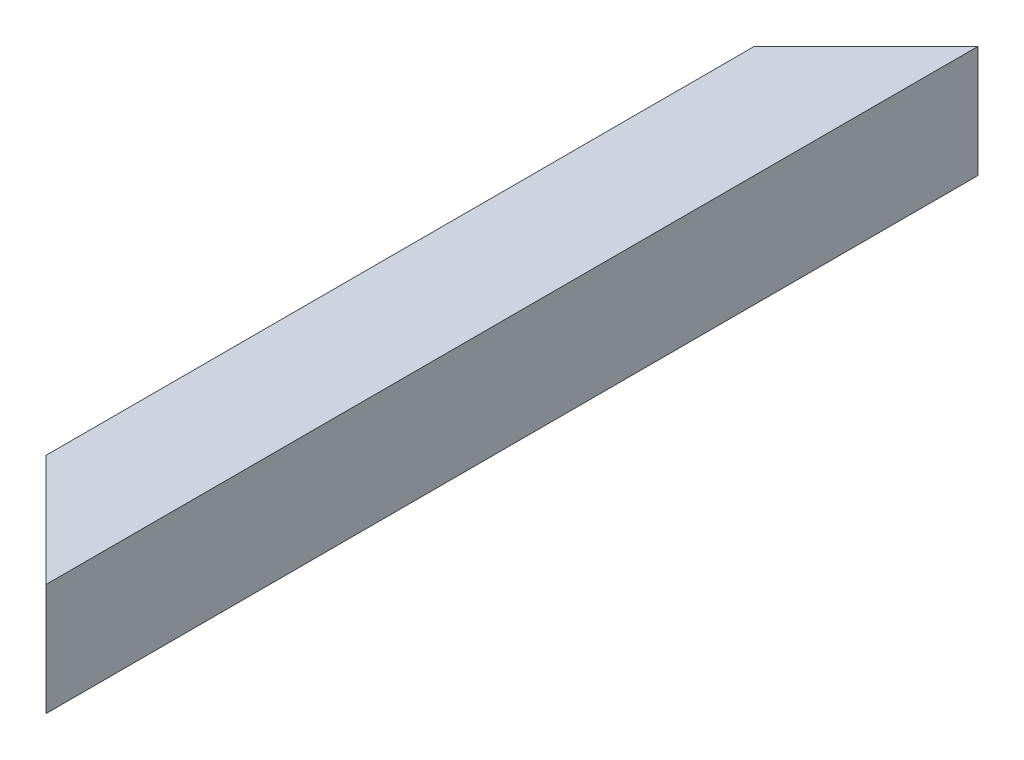
ISO-10303-21;
HEADER;
FILE_DESCRIPTION(('STEP AP214'),'2;1');
FILE_NAME('part.step','',(''),(''),'','','');
FILE_SCHEMA(('AUTOMOTIVE_DESIGN { 1 0 10303 214 1 1 1 1 }'));
ENDSEC;
DATA;
#1=APPLICATION_CONTEXT('core data for automotive mechanical design processes');
#2=APPLICATION_PROTOCOL_DEFINITION('international standard','automotive_design',2000,#1);
#3=PRODUCT_CONTEXT('',#1,'mechanical');
#4=PRODUCT('Part','Part','',(#3));
#5=PRODUCT_RELATED_PRODUCT_CATEGORY('part','',(#4));
#6=PRODUCT_DEFINITION_FORMATION('','',#4);
#7=PRODUCT_DEFINITION_CONTEXT('part definition',#1,'design');
#8=PRODUCT_DEFINITION('design','',#6,#7);
#9=PRODUCT_DEFINITION_SHAPE('','',#8);
#10=(LENGTH_UNIT() NAMED_UNIT(*) SI_UNIT(.MILLI.,.METRE.));
#11=(NAMED_UNIT(*) PLANE_ANGLE_UNIT() SI_UNIT($,.RADIAN.));
#12=(NAMED_UNIT(*) SI_UNIT($,.STERADIAN.) SOLID_ANGLE_UNIT());
#13=UNCERTAINTY_MEASURE_WITH_UNIT(LENGTH_MEASURE(1.E-05),#10,'distance_accuracy_value','');
#14=(GEOMETRIC_REPRESENTATION_CONTEXT(3) GLOBAL_UNCERTAINTY_ASSIGNED_CONTEXT((#13)) GLOBAL_UNIT_ASSIGNED_CONTEXT((#10,
#11,#12)) REPRESENTATION_CONTEXT('',''));
#15=CARTESIAN_POINT('',(0.,0.,0.));
#16=DIRECTION('',(0.,0.,1.));
#17=DIRECTION('',(1.,0.,0.));
#18=AXIS2_PLACEMENT_3D('',#15,#16,#17);
#19=CARTESIAN_POINT('',(-26.,26.,0.));
#20=DIRECTION('',(1.,0.,0.));
#21=DIRECTION('',(0.,0.,-1.));
#22=AXIS2_PLACEMENT_3D('',#19,#20,#21);
#23=PLANE('',#22);
#24=DIRECTION('',(0.,-1.,0.));
#25=VECTOR('',#24,1.);
#26=CARTESIAN_POINT('',(-26.,26.,55.9999999999994));
#27=LINE('',#26,#25);
#28=CARTESIAN_POINT('',(-26.,26.,55.9999999999994));
#29=VERTEX_POINT('',#28);
#30=CARTESIAN_POINT('',(-26.,-26.,55.9999999999994));
#31=VERTEX_POINT('',#30);
#32=EDGE_CURVE('E11',#29,#31,#27,.T.);
#33=ORIENTED_EDGE('',*,*,#32,.F.);
#34=DIRECTION('',(0.,0.,1.));
#35=VECTOR('',#34,1.);
#36=CARTESIAN_POINT('',(-26.,26.,0.));
#37=LINE('',#36,#35);
#38=CARTESIAN_POINT('',(-26.,26.,444.000000000001));
#39=VERTEX_POINT('',#38);
#40=EDGE_CURVE('E145',#29,#39,#37,.T.);
#41=ORIENTED_EDGE('',*,*,#40,.T.);
#42=DIRECTION('',(0.,1.,0.));
#43=VECTOR('',#42,1.);
#44=CARTESIAN_POINT('',(-26.,26.,444.000000000001));
#45=LINE('',#44,#43);
#46=CARTESIAN_POINT('',(-26.,-26.,444.000000000001));
#47=VERTEX_POINT('',#46);
#48=EDGE_CURVE('E43',#47,#39,#45,.T.);
#49=ORIENTED_EDGE('',*,*,#48,.F.);
#50=DIRECTION('',(0.,0.,1.));
#51=VECTOR('',#50,1.);
#52=CARTESIAN_POINT('',(-26.,-26.,0.));
#53=LINE('',#52,#51);
#54=EDGE_CURVE('E132',#31,#47,#53,.T.);
#55=ORIENTED_EDGE('',*,*,#54,.F.);
#56=EDGE_LOOP('',(#33,#41,#49,#55));
#57=FACE_BOUND('',#56,.T.);
#58=ADVANCED_FACE('F35',(#57),#23,.T.);
#59=CARTESIAN_POINT('',(-26.,-26.,0.));
#60=DIRECTION('',(0.,1.,0.));
#61=DIRECTION('',(0.,0.,1.));
#62=AXIS2_PLACEMENT_3D('',#59,#60,#61);
#63=PLANE('',#62);
#64=DIRECTION('',(0.707106781186551,0.,-0.707106781186544));
#65=VECTOR('',#64,1.);
#66=CARTESIAN_POINT('',(1.9999999999997,-26.,28.));
#67=LINE('',#66,#65);
#68=CARTESIAN_POINT('',(26.,-26.,3.99999999999995));
#69=VERTEX_POINT('',#68);
#70=EDGE_CURVE('E165',#31,#69,#67,.T.);
#71=ORIENTED_EDGE('',*,*,#70,.F.);
#72=ORIENTED_EDGE('',*,*,#54,.T.);
#73=DIRECTION('',(-0.707106781186551,0.,-0.707106781186544));
#74=VECTOR('',#73,1.);
#75=CARTESIAN_POINT('',(-248.,-26.,222.000000000003));
#76=LINE('',#75,#74);
#77=CARTESIAN_POINT('',(26.,-26.,496.));
#78=VERTEX_POINT('',#77);
#79=EDGE_CURVE('E57',#78,#47,#76,.T.);
#80=ORIENTED_EDGE('',*,*,#79,.F.);
#81=DIRECTION('',(0.,0.,1.));
#82=VECTOR('',#81,1.);
#83=CARTESIAN_POINT('',(26.,-26.,0.));
#84=LINE('',#83,#82);
#85=EDGE_CURVE('E135',#69,#78,#84,.T.);
#86=ORIENTED_EDGE('',*,*,#85,.F.);
#87=EDGE_LOOP('',(#71,#72,#80,#86));
#88=FACE_BOUND('',#87,.T.);
#89=ADVANCED_FACE('F181',(#88),#63,.T.);
#90=CARTESIAN_POINT('',(26.,26.,0.));
#91=DIRECTION('',(-1.,0.,0.));
#92=DIRECTION('',(0.,0.,1.));
#93=AXIS2_PLACEMENT_3D('',#90,#91,#92);
#94=PLANE('',#93);
#95=DIRECTION('',(0.,1.,0.));
#96=VECTOR('',#95,1.);
#97=CARTESIAN_POINT('',(26.,26.,3.99999999999995));
#98=LINE('',#97,#96);
#99=CARTESIAN_POINT('',(26.,26.,3.99999999999995));
#100=VERTEX_POINT('',#99);
#101=EDGE_CURVE('E167',#69,#100,#98,.T.);
#102=ORIENTED_EDGE('',*,*,#101,.F.);
#103=ORIENTED_EDGE('',*,*,#85,.T.);
#104=DIRECTION('',(0.,-1.,0.));
#105=VECTOR('',#104,1.);
#106=CARTESIAN_POINT('',(26.,26.,496.));
#107=LINE('',#106,#105);
#108=CARTESIAN_POINT('',(26.,26.,496.));
#109=VERTEX_POINT('',#108);
#110=EDGE_CURVE('E161',#109,#78,#107,.T.);
#111=ORIENTED_EDGE('',*,*,#110,.F.);
#112=DIRECTION('',(0.,0.,1.));
#113=VECTOR('',#112,1.);
#114=CARTESIAN_POINT('',(26.,26.,0.));
#115=LINE('',#114,#113);
#116=EDGE_CURVE('E141',#100,#109,#115,.T.);
#117=ORIENTED_EDGE('',*,*,#116,.F.);
#118=EDGE_LOOP('',(#102,#103,#111,#117));
#119=FACE_BOUND('',#118,.T.);
#120=ADVANCED_FACE('F178',(#119),#94,.T.);
#121=CARTESIAN_POINT('',(-26.,26.,0.));
#122=DIRECTION('',(0.,-1.,0.));
#123=DIRECTION('',(0.,0.,-1.));
#124=AXIS2_PLACEMENT_3D('',#121,#122,#123);
#125=PLANE('',#124);
#126=DIRECTION('',(-0.707106781186551,0.,0.707106781186544));
#127=VECTOR('',#126,1.);
#128=CARTESIAN_POINT('',(1.9999999999997,26.,28.));
#129=LINE('',#128,#127);
#130=EDGE_CURVE('E49',#100,#29,#129,.T.);
#131=ORIENTED_EDGE('',*,*,#130,.F.);
#132=ORIENTED_EDGE('',*,*,#116,.T.);
#133=DIRECTION('',(0.707106781186551,0.,0.707106781186544));
#134=VECTOR('',#133,1.);
#135=CARTESIAN_POINT('',(-248.,26.,222.000000000003));
#136=LINE('',#135,#134);
#137=EDGE_CURVE('E163',#39,#109,#136,.T.);
#138=ORIENTED_EDGE('',*,*,#137,.F.);
#139=ORIENTED_EDGE('',*,*,#40,.F.);
#140=EDGE_LOOP('',(#131,#132,#138,#139));
#141=FACE_BOUND('',#140,.T.);
#142=ADVANCED_FACE('F173',(#141),#125,.T.);
#143=CARTESIAN_POINT('',(30.,-30.,500.));
#144=DIRECTION('',(0.707106781186544,0.,-0.707106781186551));
#145=DIRECTION('',(-0.707106781186551,0.,-0.707106781186544));
#146=AXIS2_PLACEMENT_3D('',#143,#144,#145);
#147=PLANE('',#146);
#148=ORIENTED_EDGE('',*,*,#137,.T.);
#149=ORIENTED_EDGE('',*,*,#110,.T.);
#150=ORIENTED_EDGE('',*,*,#79,.T.);
#151=ORIENTED_EDGE('',*,*,#48,.T.);
#152=EDGE_LOOP('',(#148,#149,#150,#151));
#153=FACE_BOUND('',#152,.T.);
#154=DIRECTION('',(-0.707106781186551,0.,-0.707106781186543));
#155=VECTOR('',#154,1.);
#156=CARTESIAN_POINT('',(30.,30.,500.));
#157=LINE('',#156,#155);
#158=CARTESIAN_POINT('',(30.,30.,500.));
#159=VERTEX_POINT('',#158);
#160=CARTESIAN_POINT('',(-30.,30.,440.000000000001));
#161=VERTEX_POINT('',#160);
#162=EDGE_CURVE('E154',#159,#161,#157,.T.);
#163=ORIENTED_EDGE('',*,*,#162,.T.);
#164=DIRECTION('',(0.,1.,0.));
#165=VECTOR('',#164,1.);
#166=CARTESIAN_POINT('',(-30.,-30.,440.000000000001));
#167=LINE('',#166,#165);
#168=CARTESIAN_POINT('',(-30.,-30.,440.000000000001));
#169=VERTEX_POINT('',#168);
#170=EDGE_CURVE('E156',#169,#161,#167,.T.);
#171=ORIENTED_EDGE('',*,*,#170,.F.);
#172=DIRECTION('',(-0.707106781186551,0.,-0.707106781186543));
#173=VECTOR('',#172,1.);
#174=CARTESIAN_POINT('',(30.,-30.,500.));
#175=LINE('',#174,#173);
#176=CARTESIAN_POINT('',(30.,-30.,500.));
#177=VERTEX_POINT('',#176);
#178=EDGE_CURVE('E122',#177,#169,#175,.T.);
#179=ORIENTED_EDGE('',*,*,#178,.F.);
#180=DIRECTION('',(0.,1.,0.));
#181=VECTOR('',#180,1.);
#182=CARTESIAN_POINT('',(30.,30.,500.));
#183=LINE('',#182,#181);
#184=EDGE_CURVE('E144',#177,#159,#183,.T.);
#185=ORIENTED_EDGE('',*,*,#184,.T.);
#186=EDGE_LOOP('',(#163,#171,#179,#185));
#187=FACE_BOUND('',#186,.T.);
#188=ADVANCED_FACE('F180',(#153,#187),#147,.F.);
#189=CARTESIAN_POINT('',(30.,-30.,0.));
#190=DIRECTION('',(0.707106781186544,0.,0.707106781186551));
#191=DIRECTION('',(0.707106781186551,0.,-0.707106781186544));
#192=AXIS2_PLACEMENT_3D('',#189,#190,#191);
#193=PLANE('',#192);
#194=ORIENTED_EDGE('',*,*,#130,.T.);
#195=ORIENTED_EDGE('',*,*,#32,.T.);
#196=ORIENTED_EDGE('',*,*,#70,.T.);
#197=ORIENTED_EDGE('',*,*,#101,.T.);
#198=EDGE_LOOP('',(#194,#195,#196,#197));
#199=FACE_BOUND('',#198,.T.);
#200=DIRECTION('',(0.707106781186551,0.,-0.707106781186544));
#201=VECTOR('',#200,1.);
#202=CARTESIAN_POINT('',(30.,30.,0.));
#203=LINE('',#202,#201);
#204=CARTESIAN_POINT('',(-30.,30.,59.9999999999994));
#205=VERTEX_POINT('',#204);
#206=CARTESIAN_POINT('',(30.,30.,0.));
#207=VERTEX_POINT('',#206);
#208=EDGE_CURVE('E109',#205,#207,#203,.T.);
#209=ORIENTED_EDGE('',*,*,#208,.T.);
#210=DIRECTION('',(0.,1.,0.));
#211=VECTOR('',#210,1.);
#212=CARTESIAN_POINT('',(30.,30.,0.));
#213=LINE('',#212,#211);
#214=CARTESIAN_POINT('',(30.,-30.,0.));
#215=VERTEX_POINT('',#214);
#216=EDGE_CURVE('E104',#215,#207,#213,.T.);
#217=ORIENTED_EDGE('',*,*,#216,.F.);
#218=DIRECTION('',(0.707106781186551,0.,-0.707106781186544));
#219=VECTOR('',#218,1.);
#220=CARTESIAN_POINT('',(30.,-30.,0.));
#221=LINE('',#220,#219);
#222=CARTESIAN_POINT('',(-30.,-30.,59.9999999999994));
#223=VERTEX_POINT('',#222);
#224=EDGE_CURVE('E98',#223,#215,#221,.T.);
#225=ORIENTED_EDGE('',*,*,#224,.F.);
#226=DIRECTION('',(0.,1.,0.));
#227=VECTOR('',#226,1.);
#228=CARTESIAN_POINT('',(-30.,-30.,59.9999999999994));
#229=LINE('',#228,#227);
#230=EDGE_CURVE('E101',#223,#205,#229,.T.);
#231=ORIENTED_EDGE('',*,*,#230,.T.);
#232=EDGE_LOOP('',(#209,#217,#225,#231));
#233=FACE_BOUND('',#232,.T.);
#234=ADVANCED_FACE('F100',(#199,#233),#193,.F.);
#235=CARTESIAN_POINT('',(-30.,30.,0.));
#236=DIRECTION('',(-1.,0.,0.));
#237=DIRECTION('',(0.,0.,1.));
#238=AXIS2_PLACEMENT_3D('',#235,#236,#237);
#239=PLANE('',#238);
#240=ORIENTED_EDGE('',*,*,#230,.F.);
#241=DIRECTION('',(0.,0.,1.));
#242=VECTOR('',#241,1.);
#243=CARTESIAN_POINT('',(-30.,-30.,0.));
#244=LINE('',#243,#242);
#245=EDGE_CURVE('E116',#223,#169,#244,.T.);
#246=ORIENTED_EDGE('',*,*,#245,.T.);
#247=ORIENTED_EDGE('',*,*,#170,.T.);
#248=DIRECTION('',(0.,0.,1.));
#249=VECTOR('',#248,1.);
#250=CARTESIAN_POINT('',(-30.,30.,0.));
#251=LINE('',#250,#249);
#252=EDGE_CURVE('E118',#205,#161,#251,.T.);
#253=ORIENTED_EDGE('',*,*,#252,.F.);
#254=EDGE_LOOP('',(#240,#246,#247,#253));
#255=FACE_BOUND('',#254,.T.);
#256=ADVANCED_FACE('F114',(#255),#239,.T.);
#257=CARTESIAN_POINT('',(-30.,-30.,0.));
#258=DIRECTION('',(0.,-1.,0.));
#259=DIRECTION('',(0.,0.,-1.));
#260=AXIS2_PLACEMENT_3D('',#257,#258,#259);
#261=PLANE('',#260);
#262=ORIENTED_EDGE('',*,*,#224,.T.);
#263=DIRECTION('',(0.,0.,1.));
#264=VECTOR('',#263,1.);
#265=CARTESIAN_POINT('',(30.,-30.,0.));
#266=LINE('',#265,#264);
#267=EDGE_CURVE('E123',#215,#177,#266,.T.);
#268=ORIENTED_EDGE('',*,*,#267,.T.);
#269=ORIENTED_EDGE('',*,*,#178,.T.);
#270=ORIENTED_EDGE('',*,*,#245,.F.);
#271=EDGE_LOOP('',(#262,#268,#269,#270));
#272=FACE_BOUND('',#271,.T.);
#273=ADVANCED_FACE('F121',(#272),#261,.T.);
#274=CARTESIAN_POINT('',(30.,30.,0.));
#275=DIRECTION('',(1.,0.,0.));
#276=DIRECTION('',(0.,0.,-1.));
#277=AXIS2_PLACEMENT_3D('',#274,#275,#276);
#278=PLANE('',#277);
#279=DIRECTION('',(0.,0.,1.));
#280=VECTOR('',#279,1.);
#281=CARTESIAN_POINT('',(30.,30.,0.));
#282=LINE('',#281,#280);
#283=EDGE_CURVE('E125',#207,#159,#282,.T.);
#284=ORIENTED_EDGE('',*,*,#283,.T.);
#285=ORIENTED_EDGE('',*,*,#184,.F.);
#286=ORIENTED_EDGE('',*,*,#267,.F.);
#287=ORIENTED_EDGE('',*,*,#216,.T.);
#288=EDGE_LOOP('',(#284,#285,#286,#287));
#289=FACE_BOUND('',#288,.T.);
#290=ADVANCED_FACE('F152',(#289),#278,.T.);
#291=CARTESIAN_POINT('',(-30.,30.,0.));
#292=DIRECTION('',(0.,1.,0.));
#293=DIRECTION('',(0.,0.,1.));
#294=AXIS2_PLACEMENT_3D('',#291,#292,#293);
#295=PLANE('',#294);
#296=ORIENTED_EDGE('',*,*,#208,.F.);
#297=ORIENTED_EDGE('',*,*,#252,.T.);
#298=ORIENTED_EDGE('',*,*,#162,.F.);
#299=ORIENTED_EDGE('',*,*,#283,.F.);
#300=EDGE_LOOP('',(#296,#297,#298,#299));
#301=FACE_BOUND('',#300,.T.);
#302=ADVANCED_FACE('F37',(#301),#295,.T.);
#303=CLOSED_SHELL('',(#58,#89,#120,#142,#188,#234,#256,#273,#290,#302));
#304=MANIFOLD_SOLID_BREP('B2',#303);
#305=ADVANCED_BREP_SHAPE_REPRESENTATION('',(#18,#304),#14);
#306=SHAPE_DEFINITION_REPRESENTATION(#9,#305);
ENDSEC;
END-ISO-10303-21;
